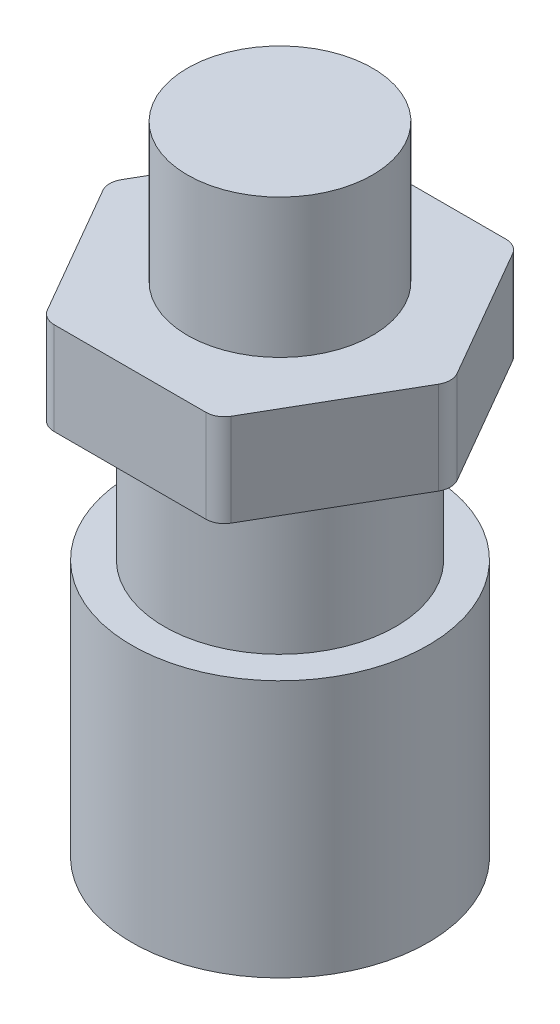
ISO-10303-21;
HEADER;
FILE_DESCRIPTION(('STEP AP214'),'2;1');
FILE_NAME('part.step','',(''),(''),'','','');
FILE_SCHEMA(('AUTOMOTIVE_DESIGN { 1 0 10303 214 1 1 1 1 }'));
ENDSEC;
DATA;
#1=APPLICATION_CONTEXT('core data for automotive mechanical design processes');
#2=APPLICATION_PROTOCOL_DEFINITION('international standard','automotive_design',2000,#1);
#3=PRODUCT_CONTEXT('',#1,'mechanical');
#4=PRODUCT('Part','Part','',(#3));
#5=PRODUCT_RELATED_PRODUCT_CATEGORY('part','',(#4));
#6=PRODUCT_DEFINITION_FORMATION('','',#4);
#7=PRODUCT_DEFINITION_CONTEXT('part definition',#1,'design');
#8=PRODUCT_DEFINITION('design','',#6,#7);
#9=PRODUCT_DEFINITION_SHAPE('','',#8);
#10=(LENGTH_UNIT() NAMED_UNIT(*) SI_UNIT(.MILLI.,.METRE.));
#11=(NAMED_UNIT(*) PLANE_ANGLE_UNIT() SI_UNIT($,.RADIAN.));
#12=(NAMED_UNIT(*) SI_UNIT($,.STERADIAN.) SOLID_ANGLE_UNIT());
#13=UNCERTAINTY_MEASURE_WITH_UNIT(LENGTH_MEASURE(1.E-05),#10,'distance_accuracy_value','');
#14=(GEOMETRIC_REPRESENTATION_CONTEXT(3) GLOBAL_UNCERTAINTY_ASSIGNED_CONTEXT((#13)) GLOBAL_UNIT_ASSIGNED_CONTEXT((#10,
#11,#12)) REPRESENTATION_CONTEXT('',''));
#15=CARTESIAN_POINT('',(0.,0.,0.));
#16=DIRECTION('',(0.,0.,1.));
#17=DIRECTION('',(1.,0.,0.));
#18=AXIS2_PLACEMENT_3D('',#15,#16,#17);
#19=CARTESIAN_POINT('',(-23.7568088766147,12.7,0.));
#20=DIRECTION('',(0.866025403784439,0.,0.5));
#21=DIRECTION('',(0.5,0.,-0.866025403784439));
#22=AXIS2_PLACEMENT_3D('',#19,#20,#21);
#23=PLANE('',#22);
#24=DIRECTION('',(-0.5,0.,0.866025403784439));
#25=VECTOR('',#24,1.);
#26=CARTESIAN_POINT('',(-23.7568088766147,0.,0.));
#27=LINE('',#26,#25);
#28=CARTESIAN_POINT('',(-12.6116392801782,0.,-19.304));
#29=VERTEX_POINT('',#28);
#30=CARTESIAN_POINT('',(-23.0235740347439,0.,-1.27));
#31=VERTEX_POINT('',#30);
#32=EDGE_CURVE('E162',#29,#31,#27,.T.);
#33=ORIENTED_EDGE('',*,*,#32,.T.);
#34=DIRECTION('',(0.,-1.,0.));
#35=VECTOR('',#34,1.);
#36=CARTESIAN_POINT('',(-23.0235740347439,12.7,-1.27));
#37=LINE('',#36,#35);
#38=CARTESIAN_POINT('',(-23.0235740347439,12.7,-1.27));
#39=VERTEX_POINT('',#38);
#40=EDGE_CURVE('E197',#31,#39,#37,.F.);
#41=ORIENTED_EDGE('',*,*,#40,.T.);
#42=DIRECTION('',(-0.5,0.,0.866025403784439));
#43=VECTOR('',#42,1.);
#44=CARTESIAN_POINT('',(-23.7568088766147,12.7,0.));
#45=LINE('',#44,#43);
#46=CARTESIAN_POINT('',(-12.6116392801782,12.7,-19.304));
#47=VERTEX_POINT('',#46);
#48=EDGE_CURVE('E170',#47,#39,#45,.T.);
#49=ORIENTED_EDGE('',*,*,#48,.F.);
#50=DIRECTION('',(0.,-1.,0.));
#51=VECTOR('',#50,1.);
#52=CARTESIAN_POINT('',(-12.6116392801782,12.7,-19.304));
#53=LINE('',#52,#51);
#54=EDGE_CURVE('E194',#47,#29,#53,.T.);
#55=ORIENTED_EDGE('',*,*,#54,.T.);
#56=EDGE_LOOP('',(#33,#41,#49,#55));
#57=FACE_BOUND('',#56,.T.);
#58=ADVANCED_FACE('F36',(#57),#23,.F.);
#59=CARTESIAN_POINT('',(-11.8784044383074,12.7,20.574));
#60=DIRECTION('',(0.866025403784439,0.,-0.5));
#61=DIRECTION('',(-0.5,0.,-0.866025403784439));
#62=AXIS2_PLACEMENT_3D('',#59,#60,#61);
#63=PLANE('',#62);
#64=DIRECTION('',(0.5,0.,0.866025403784439));
#65=VECTOR('',#64,1.);
#66=CARTESIAN_POINT('',(-11.8784044383074,0.,20.574));
#67=LINE('',#66,#65);
#68=CARTESIAN_POINT('',(-23.0235740347439,0.,1.26999999999999));
#69=VERTEX_POINT('',#68);
#70=CARTESIAN_POINT('',(-12.6116392801782,0.,19.304));
#71=VERTEX_POINT('',#70);
#72=EDGE_CURVE('E157',#69,#71,#67,.T.);
#73=ORIENTED_EDGE('',*,*,#72,.T.);
#74=DIRECTION('',(0.,-1.,0.));
#75=VECTOR('',#74,1.);
#76=CARTESIAN_POINT('',(-12.6116392801782,12.7,19.304));
#77=LINE('',#76,#75);
#78=CARTESIAN_POINT('',(-12.6116392801782,12.7,19.304));
#79=VERTEX_POINT('',#78);
#80=EDGE_CURVE('E133',#71,#79,#77,.F.);
#81=ORIENTED_EDGE('',*,*,#80,.T.);
#82=DIRECTION('',(0.5,0.,0.866025403784439));
#83=VECTOR('',#82,1.);
#84=CARTESIAN_POINT('',(-11.8784044383074,12.7,20.574));
#85=LINE('',#84,#83);
#86=CARTESIAN_POINT('',(-23.0235740347439,12.7,1.26999999999999));
#87=VERTEX_POINT('',#86);
#88=EDGE_CURVE('E249',#87,#79,#85,.T.);
#89=ORIENTED_EDGE('',*,*,#88,.F.);
#90=DIRECTION('',(0.,-1.,0.));
#91=VECTOR('',#90,1.);
#92=CARTESIAN_POINT('',(-23.0235740347439,12.7,1.27));
#93=LINE('',#92,#91);
#94=EDGE_CURVE('E138',#87,#69,#93,.T.);
#95=ORIENTED_EDGE('',*,*,#94,.T.);
#96=EDGE_LOOP('',(#73,#81,#89,#95));
#97=FACE_BOUND('',#96,.T.);
#98=ADVANCED_FACE('F264',(#97),#63,.F.);
#99=CARTESIAN_POINT('',(11.8784044383074,12.7,20.574));
#100=DIRECTION('',(0.,0.,-1.));
#101=DIRECTION('',(-1.,0.,0.));
#102=AXIS2_PLACEMENT_3D('',#99,#100,#101);
#103=PLANE('',#102);
#104=DIRECTION('',(1.,0.,0.));
#105=VECTOR('',#104,1.);
#106=CARTESIAN_POINT('',(11.8784044383074,12.7,20.574));
#107=LINE('',#106,#105);
#108=CARTESIAN_POINT('',(-10.4119347545657,12.7,20.574));
#109=VERTEX_POINT('',#108);
#110=CARTESIAN_POINT('',(10.4119347545657,12.7,20.574));
#111=VERTEX_POINT('',#110);
#112=EDGE_CURVE('E148',#109,#111,#107,.T.);
#113=ORIENTED_EDGE('',*,*,#112,.F.);
#114=DIRECTION('',(0.,-1.,0.));
#115=VECTOR('',#114,1.);
#116=CARTESIAN_POINT('',(-10.4119347545657,12.7,20.574));
#117=LINE('',#116,#115);
#118=CARTESIAN_POINT('',(-10.4119347545657,0.,20.574));
#119=VERTEX_POINT('',#118);
#120=EDGE_CURVE('E132',#109,#119,#117,.T.);
#121=ORIENTED_EDGE('',*,*,#120,.T.);
#122=DIRECTION('',(1.,0.,0.));
#123=VECTOR('',#122,1.);
#124=CARTESIAN_POINT('',(11.8784044383074,0.,20.574));
#125=LINE('',#124,#123);
#126=CARTESIAN_POINT('',(10.4119347545657,0.,20.574));
#127=VERTEX_POINT('',#126);
#128=EDGE_CURVE('E145',#119,#127,#125,.T.);
#129=ORIENTED_EDGE('',*,*,#128,.T.);
#130=DIRECTION('',(0.,-1.,0.));
#131=VECTOR('',#130,1.);
#132=CARTESIAN_POINT('',(10.4119347545657,12.7,20.574));
#133=LINE('',#132,#131);
#134=EDGE_CURVE('E150',#127,#111,#133,.F.);
#135=ORIENTED_EDGE('',*,*,#134,.T.);
#136=EDGE_LOOP('',(#113,#121,#129,#135));
#137=FACE_BOUND('',#136,.T.);
#138=ADVANCED_FACE('F144',(#137),#103,.F.);
#139=CARTESIAN_POINT('',(23.7568088766147,12.7,0.));
#140=DIRECTION('',(-0.866025403784438,0.,-0.5));
#141=DIRECTION('',(-0.5,0.,0.866025403784439));
#142=AXIS2_PLACEMENT_3D('',#139,#140,#141);
#143=PLANE('',#142);
#144=DIRECTION('',(0.5,0.,-0.866025403784439));
#145=VECTOR('',#144,1.);
#146=CARTESIAN_POINT('',(23.7568088766147,12.7,0.));
#147=LINE('',#146,#145);
#148=CARTESIAN_POINT('',(12.6116392801782,12.7,19.304));
#149=VERTEX_POINT('',#148);
#150=CARTESIAN_POINT('',(23.0235740347439,12.7,1.27));
#151=VERTEX_POINT('',#150);
#152=EDGE_CURVE('E215',#149,#151,#147,.T.);
#153=ORIENTED_EDGE('',*,*,#152,.F.);
#154=DIRECTION('',(0.,-1.,0.));
#155=VECTOR('',#154,1.);
#156=CARTESIAN_POINT('',(12.6116392801782,12.7,19.304));
#157=LINE('',#156,#155);
#158=CARTESIAN_POINT('',(12.6116392801782,0.,19.304));
#159=VERTEX_POINT('',#158);
#160=EDGE_CURVE('E40',#149,#159,#157,.T.);
#161=ORIENTED_EDGE('',*,*,#160,.T.);
#162=DIRECTION('',(0.5,0.,-0.866025403784439));
#163=VECTOR('',#162,1.);
#164=CARTESIAN_POINT('',(23.7568088766147,0.,0.));
#165=LINE('',#164,#163);
#166=CARTESIAN_POINT('',(23.0235740347439,0.,1.27));
#167=VERTEX_POINT('',#166);
#168=EDGE_CURVE('E156',#159,#167,#165,.T.);
#169=ORIENTED_EDGE('',*,*,#168,.T.);
#170=DIRECTION('',(0.,-1.,0.));
#171=VECTOR('',#170,1.);
#172=CARTESIAN_POINT('',(23.0235740347439,12.7,1.27));
#173=LINE('',#172,#171);
#174=EDGE_CURVE('E207',#167,#151,#173,.F.);
#175=ORIENTED_EDGE('',*,*,#174,.T.);
#176=EDGE_LOOP('',(#153,#161,#169,#175));
#177=FACE_BOUND('',#176,.T.);
#178=ADVANCED_FACE('F214',(#177),#143,.F.);
#179=CARTESIAN_POINT('',(11.8784044383074,12.7,-20.574));
#180=DIRECTION('',(-0.866025403784439,0.,0.5));
#181=DIRECTION('',(0.5,0.,0.866025403784439));
#182=AXIS2_PLACEMENT_3D('',#179,#180,#181);
#183=PLANE('',#182);
#184=DIRECTION('',(-0.5,0.,-0.866025403784439));
#185=VECTOR('',#184,1.);
#186=CARTESIAN_POINT('',(11.8784044383074,0.,-20.574));
#187=LINE('',#186,#185);
#188=CARTESIAN_POINT('',(23.0235740347439,0.,-1.27));
#189=VERTEX_POINT('',#188);
#190=CARTESIAN_POINT('',(12.6116392801782,0.,-19.304));
#191=VERTEX_POINT('',#190);
#192=EDGE_CURVE('E160',#189,#191,#187,.T.);
#193=ORIENTED_EDGE('',*,*,#192,.T.);
#194=DIRECTION('',(0.,-1.,0.));
#195=VECTOR('',#194,1.);
#196=CARTESIAN_POINT('',(12.6116392801782,12.7,-19.304));
#197=LINE('',#196,#195);
#198=CARTESIAN_POINT('',(12.6116392801782,12.7,-19.304));
#199=VERTEX_POINT('',#198);
#200=EDGE_CURVE('E206',#191,#199,#197,.F.);
#201=ORIENTED_EDGE('',*,*,#200,.T.);
#202=DIRECTION('',(-0.5,0.,-0.866025403784439));
#203=VECTOR('',#202,1.);
#204=CARTESIAN_POINT('',(11.8784044383074,12.7,-20.574));
#205=LINE('',#204,#203);
#206=CARTESIAN_POINT('',(23.0235740347439,12.7,-1.27));
#207=VERTEX_POINT('',#206);
#208=EDGE_CURVE('E226',#207,#199,#205,.T.);
#209=ORIENTED_EDGE('',*,*,#208,.F.);
#210=DIRECTION('',(0.,-1.,0.));
#211=VECTOR('',#210,1.);
#212=CARTESIAN_POINT('',(23.0235740347439,12.7,-1.27));
#213=LINE('',#212,#211);
#214=EDGE_CURVE('E203',#207,#189,#213,.T.);
#215=ORIENTED_EDGE('',*,*,#214,.T.);
#216=EDGE_LOOP('',(#193,#201,#209,#215));
#217=FACE_BOUND('',#216,.T.);
#218=ADVANCED_FACE('F224',(#217),#183,.F.);
#219=CARTESIAN_POINT('',(-11.8784044383074,12.7,-20.574));
#220=DIRECTION('',(0.,0.,1.));
#221=DIRECTION('',(1.,0.,0.));
#222=AXIS2_PLACEMENT_3D('',#219,#220,#221);
#223=PLANE('',#222);
#224=DIRECTION('',(-1.,0.,0.));
#225=VECTOR('',#224,1.);
#226=CARTESIAN_POINT('',(-11.8784044383074,0.,-20.574));
#227=LINE('',#226,#225);
#228=CARTESIAN_POINT('',(10.4119347545657,0.,-20.574));
#229=VERTEX_POINT('',#228);
#230=CARTESIAN_POINT('',(-10.4119347545657,0.,-20.574));
#231=VERTEX_POINT('',#230);
#232=EDGE_CURVE('E168',#229,#231,#227,.T.);
#233=ORIENTED_EDGE('',*,*,#232,.T.);
#234=DIRECTION('',(0.,-1.,0.));
#235=VECTOR('',#234,1.);
#236=CARTESIAN_POINT('',(-10.4119347545657,12.7,-20.574));
#237=LINE('',#236,#235);
#238=CARTESIAN_POINT('',(-10.4119347545657,12.7,-20.574));
#239=VERTEX_POINT('',#238);
#240=EDGE_CURVE('E52',#231,#239,#237,.F.);
#241=ORIENTED_EDGE('',*,*,#240,.T.);
#242=DIRECTION('',(-1.,0.,0.));
#243=VECTOR('',#242,1.);
#244=CARTESIAN_POINT('',(-11.8784044383074,12.7,-20.574));
#245=LINE('',#244,#243);
#246=CARTESIAN_POINT('',(10.4119347545657,12.7,-20.574));
#247=VERTEX_POINT('',#246);
#248=EDGE_CURVE('E171',#247,#239,#245,.T.);
#249=ORIENTED_EDGE('',*,*,#248,.F.);
#250=DIRECTION('',(0.,-1.,0.));
#251=VECTOR('',#250,1.);
#252=CARTESIAN_POINT('',(10.4119347545657,12.7,-20.574));
#253=LINE('',#252,#251);
#254=EDGE_CURVE('E199',#247,#229,#253,.T.);
#255=ORIENTED_EDGE('',*,*,#254,.T.);
#256=EDGE_LOOP('',(#233,#241,#249,#255));
#257=FACE_BOUND('',#256,.T.);
#258=ADVANCED_FACE('F290',(#257),#223,.F.);
#259=CARTESIAN_POINT('',(0.,12.7,0.));
#260=DIRECTION('',(0.,-1.,0.));
#261=DIRECTION('',(0.,0.,-1.));
#262=AXIS2_PLACEMENT_3D('',#259,#260,#261);
#263=PLANE('',#262);
#264=CARTESIAN_POINT('',(0.,12.7,0.));
#265=DIRECTION('',(0.,1.,0.));
#266=DIRECTION('',(0.,0.,1.));
#267=AXIS2_PLACEMENT_3D('',#264,#265,#266);
#268=CIRCLE('',#267,12.7);
#269=CARTESIAN_POINT('',(0.,12.7,12.7));
#270=VERTEX_POINT('',#269);
#271=EDGE_CURVE('E11',#270,#270,#268,.T.);
#272=ORIENTED_EDGE('',*,*,#271,.F.);
#273=EDGE_LOOP('',(#272));
#274=FACE_BOUND('',#273,.T.);
#275=ORIENTED_EDGE('',*,*,#88,.T.);
#276=CARTESIAN_POINT('',(-10.4119347545657,12.7,18.034));
#277=DIRECTION('',(0.,-1.,0.));
#278=DIRECTION('',(0.,0.,-1.));
#279=AXIS2_PLACEMENT_3D('',#276,#277,#278);
#280=CIRCLE('',#279,2.54);
#281=EDGE_CURVE('E192',#79,#109,#280,.F.);
#282=ORIENTED_EDGE('',*,*,#281,.T.);
#283=ORIENTED_EDGE('',*,*,#112,.T.);
#284=CARTESIAN_POINT('',(10.4119347545657,12.7,18.034));
#285=DIRECTION('',(0.,-1.,0.));
#286=DIRECTION('',(0.,0.,-1.));
#287=AXIS2_PLACEMENT_3D('',#284,#285,#286);
#288=CIRCLE('',#287,2.54);
#289=EDGE_CURVE('E185',#111,#149,#288,.F.);
#290=ORIENTED_EDGE('',*,*,#289,.T.);
#291=ORIENTED_EDGE('',*,*,#152,.T.);
#292=CARTESIAN_POINT('',(20.8238695091314,12.7,0.));
#293=DIRECTION('',(0.,-1.,0.));
#294=DIRECTION('',(0.,0.,-1.));
#295=AXIS2_PLACEMENT_3D('',#292,#293,#294);
#296=CIRCLE('',#295,2.54);
#297=EDGE_CURVE('E183',#151,#207,#296,.F.);
#298=ORIENTED_EDGE('',*,*,#297,.T.);
#299=ORIENTED_EDGE('',*,*,#208,.T.);
#300=CARTESIAN_POINT('',(10.4119347545657,12.7,-18.034));
#301=DIRECTION('',(0.,-1.,0.));
#302=DIRECTION('',(0.,0.,-1.));
#303=AXIS2_PLACEMENT_3D('',#300,#301,#302);
#304=CIRCLE('',#303,2.54);
#305=EDGE_CURVE('E59',#199,#247,#304,.F.);
#306=ORIENTED_EDGE('',*,*,#305,.T.);
#307=ORIENTED_EDGE('',*,*,#248,.T.);
#308=CARTESIAN_POINT('',(-10.4119347545657,12.7,-18.034));
#309=DIRECTION('',(0.,-1.,0.));
#310=DIRECTION('',(0.,0.,-1.));
#311=AXIS2_PLACEMENT_3D('',#308,#309,#310);
#312=CIRCLE('',#311,2.54);
#313=EDGE_CURVE('E188',#239,#47,#312,.F.);
#314=ORIENTED_EDGE('',*,*,#313,.T.);
#315=ORIENTED_EDGE('',*,*,#48,.T.);
#316=CARTESIAN_POINT('',(-20.8238695091314,12.7,0.));
#317=DIRECTION('',(0.,-1.,0.));
#318=DIRECTION('',(0.,0.,-1.));
#319=AXIS2_PLACEMENT_3D('',#316,#317,#318);
#320=CIRCLE('',#319,2.54);
#321=EDGE_CURVE('E190',#39,#87,#320,.F.);
#322=ORIENTED_EDGE('',*,*,#321,.T.);
#323=EDGE_LOOP('',(#275,#282,#283,#290,#291,#298,#299,#306,#307,#314,#315,#322));
#324=FACE_BOUND('',#323,.T.);
#325=ADVANCED_FACE('F251',(#274,#324),#263,.F.);
#326=CARTESIAN_POINT('',(0.,0.,0.));
#327=DIRECTION('',(0.,-1.,0.));
#328=DIRECTION('',(0.,0.,-1.));
#329=AXIS2_PLACEMENT_3D('',#326,#327,#328);
#330=PLANE('',#329);
#331=ORIENTED_EDGE('',*,*,#128,.F.);
#332=CARTESIAN_POINT('',(-10.4119347545657,0.,18.034));
#333=DIRECTION('',(0.,-1.,0.));
#334=DIRECTION('',(0.,0.,-1.));
#335=AXIS2_PLACEMENT_3D('',#332,#333,#334);
#336=CIRCLE('',#335,2.54);
#337=EDGE_CURVE('E128',#119,#71,#336,.T.);
#338=ORIENTED_EDGE('',*,*,#337,.T.);
#339=ORIENTED_EDGE('',*,*,#72,.F.);
#340=CARTESIAN_POINT('',(-20.8238695091314,0.,0.));
#341=DIRECTION('',(0.,-1.,0.));
#342=DIRECTION('',(0.,0.,-1.));
#343=AXIS2_PLACEMENT_3D('',#340,#341,#342);
#344=CIRCLE('',#343,2.54);
#345=EDGE_CURVE('E139',#69,#31,#344,.T.);
#346=ORIENTED_EDGE('',*,*,#345,.T.);
#347=ORIENTED_EDGE('',*,*,#32,.F.);
#348=CARTESIAN_POINT('',(-10.4119347545657,0.,-18.034));
#349=DIRECTION('',(0.,-1.,0.));
#350=DIRECTION('',(0.,0.,-1.));
#351=AXIS2_PLACEMENT_3D('',#348,#349,#350);
#352=CIRCLE('',#351,2.54);
#353=EDGE_CURVE('E177',#29,#231,#352,.T.);
#354=ORIENTED_EDGE('',*,*,#353,.T.);
#355=ORIENTED_EDGE('',*,*,#232,.F.);
#356=CARTESIAN_POINT('',(10.4119347545657,0.,-18.034));
#357=DIRECTION('',(0.,-1.,0.));
#358=DIRECTION('',(0.,0.,-1.));
#359=AXIS2_PLACEMENT_3D('',#356,#357,#358);
#360=CIRCLE('',#359,2.54);
#361=EDGE_CURVE('E175',#229,#191,#360,.T.);
#362=ORIENTED_EDGE('',*,*,#361,.T.);
#363=ORIENTED_EDGE('',*,*,#192,.F.);
#364=CARTESIAN_POINT('',(20.8238695091314,0.,0.));
#365=DIRECTION('',(0.,-1.,0.));
#366=DIRECTION('',(0.,0.,-1.));
#367=AXIS2_PLACEMENT_3D('',#364,#365,#366);
#368=CIRCLE('',#367,2.54);
#369=EDGE_CURVE('E149',#189,#167,#368,.T.);
#370=ORIENTED_EDGE('',*,*,#369,.T.);
#371=ORIENTED_EDGE('',*,*,#168,.F.);
#372=CARTESIAN_POINT('',(10.4119347545657,0.,18.034));
#373=DIRECTION('',(0.,-1.,0.));
#374=DIRECTION('',(0.,0.,-1.));
#375=AXIS2_PLACEMENT_3D('',#372,#373,#374);
#376=CIRCLE('',#375,2.54);
#377=EDGE_CURVE('E155',#159,#127,#376,.T.);
#378=ORIENTED_EDGE('',*,*,#377,.T.);
#379=EDGE_LOOP('',(#331,#338,#339,#346,#347,#354,#355,#362,#363,#370,#371,#378));
#380=FACE_BOUND('',#379,.T.);
#381=CARTESIAN_POINT('',(0.,0.,0.));
#382=DIRECTION('',(0.,-1.,0.));
#383=DIRECTION('',(0.,0.,-1.));
#384=AXIS2_PLACEMENT_3D('',#381,#382,#383);
#385=CIRCLE('',#384,15.875);
#386=CARTESIAN_POINT('',(0.,0.,-15.875));
#387=VERTEX_POINT('',#386);
#388=EDGE_CURVE('E246',#387,#387,#385,.T.);
#389=ORIENTED_EDGE('',*,*,#388,.F.);
#390=EDGE_LOOP('',(#389));
#391=FACE_BOUND('',#390,.T.);
#392=ADVANCED_FACE('F152',(#380,#391),#330,.T.);
#393=CARTESIAN_POINT('',(-10.4119347545657,12.7,18.034));
#394=DIRECTION('',(0.,-1.,0.));
#395=DIRECTION('',(0.,0.,-1.));
#396=AXIS2_PLACEMENT_3D('',#393,#394,#395);
#397=CYLINDRICAL_SURFACE('',#396,2.54);
#398=ORIENTED_EDGE('',*,*,#281,.F.);
#399=ORIENTED_EDGE('',*,*,#80,.F.);
#400=ORIENTED_EDGE('',*,*,#337,.F.);
#401=ORIENTED_EDGE('',*,*,#120,.F.);
#402=EDGE_LOOP('',(#398,#399,#400,#401));
#403=FACE_BOUND('',#402,.T.);
#404=ADVANCED_FACE('F131',(#403),#397,.T.);
#405=CARTESIAN_POINT('',(-20.8238695091314,12.7,0.));
#406=DIRECTION('',(0.,-1.,0.));
#407=DIRECTION('',(0.,0.,-1.));
#408=AXIS2_PLACEMENT_3D('',#405,#406,#407);
#409=CYLINDRICAL_SURFACE('',#408,2.54);
#410=ORIENTED_EDGE('',*,*,#321,.F.);
#411=ORIENTED_EDGE('',*,*,#40,.F.);
#412=ORIENTED_EDGE('',*,*,#345,.F.);
#413=ORIENTED_EDGE('',*,*,#94,.F.);
#414=EDGE_LOOP('',(#410,#411,#412,#413));
#415=FACE_BOUND('',#414,.T.);
#416=ADVANCED_FACE('F275',(#415),#409,.T.);
#417=CARTESIAN_POINT('',(-10.4119347545657,12.7,-18.034));
#418=DIRECTION('',(0.,-1.,0.));
#419=DIRECTION('',(0.,0.,-1.));
#420=AXIS2_PLACEMENT_3D('',#417,#418,#419);
#421=CYLINDRICAL_SURFACE('',#420,2.54);
#422=ORIENTED_EDGE('',*,*,#313,.F.);
#423=ORIENTED_EDGE('',*,*,#240,.F.);
#424=ORIENTED_EDGE('',*,*,#353,.F.);
#425=ORIENTED_EDGE('',*,*,#54,.F.);
#426=EDGE_LOOP('',(#422,#423,#424,#425));
#427=FACE_BOUND('',#426,.T.);
#428=ADVANCED_FACE('F260',(#427),#421,.T.);
#429=CARTESIAN_POINT('',(10.4119347545657,12.7,-18.034));
#430=DIRECTION('',(0.,-1.,0.));
#431=DIRECTION('',(0.,0.,-1.));
#432=AXIS2_PLACEMENT_3D('',#429,#430,#431);
#433=CYLINDRICAL_SURFACE('',#432,2.54);
#434=ORIENTED_EDGE('',*,*,#305,.F.);
#435=ORIENTED_EDGE('',*,*,#200,.F.);
#436=ORIENTED_EDGE('',*,*,#361,.F.);
#437=ORIENTED_EDGE('',*,*,#254,.F.);
#438=EDGE_LOOP('',(#434,#435,#436,#437));
#439=FACE_BOUND('',#438,.T.);
#440=ADVANCED_FACE('F254',(#439),#433,.T.);
#441=CARTESIAN_POINT('',(10.4119347545657,12.7,18.034));
#442=DIRECTION('',(0.,-1.,0.));
#443=DIRECTION('',(0.,0.,-1.));
#444=AXIS2_PLACEMENT_3D('',#441,#442,#443);
#445=CYLINDRICAL_SURFACE('',#444,2.54);
#446=ORIENTED_EDGE('',*,*,#289,.F.);
#447=ORIENTED_EDGE('',*,*,#134,.F.);
#448=ORIENTED_EDGE('',*,*,#377,.F.);
#449=ORIENTED_EDGE('',*,*,#160,.F.);
#450=EDGE_LOOP('',(#446,#447,#448,#449));
#451=FACE_BOUND('',#450,.T.);
#452=ADVANCED_FACE('F252',(#451),#445,.T.);
#453=CARTESIAN_POINT('',(20.8238695091314,12.7,0.));
#454=DIRECTION('',(0.,-1.,0.));
#455=DIRECTION('',(0.,0.,-1.));
#456=AXIS2_PLACEMENT_3D('',#453,#454,#455);
#457=CYLINDRICAL_SURFACE('',#456,2.54);
#458=ORIENTED_EDGE('',*,*,#297,.F.);
#459=ORIENTED_EDGE('',*,*,#174,.F.);
#460=ORIENTED_EDGE('',*,*,#369,.F.);
#461=ORIENTED_EDGE('',*,*,#214,.F.);
#462=EDGE_LOOP('',(#458,#459,#460,#461));
#463=FACE_BOUND('',#462,.T.);
#464=ADVANCED_FACE('F38',(#463),#457,.T.);
#465=CARTESIAN_POINT('',(0.,-20.32,0.));
#466=DIRECTION('',(0.,1.,0.));
#467=DIRECTION('',(0.,0.,1.));
#468=AXIS2_PLACEMENT_3D('',#465,#466,#467);
#469=CYLINDRICAL_SURFACE('',#468,15.875);
#470=CARTESIAN_POINT('',(0.,-20.32,0.));
#471=DIRECTION('',(0.,-1.,0.));
#472=DIRECTION('',(0.,0.,-1.));
#473=AXIS2_PLACEMENT_3D('',#470,#471,#472);
#474=CIRCLE('',#473,15.875);
#475=CARTESIAN_POINT('',(0.,-20.32,-15.875));
#476=VERTEX_POINT('',#475);
#477=EDGE_CURVE('E242',#476,#476,#474,.T.);
#478=ORIENTED_EDGE('',*,*,#477,.F.);
#479=EDGE_LOOP('',(#478));
#480=FACE_BOUND('',#479,.T.);
#481=ORIENTED_EDGE('',*,*,#388,.T.);
#482=EDGE_LOOP('',(#481));
#483=FACE_BOUND('',#482,.T.);
#484=ADVANCED_FACE('F259',(#480,#483),#469,.T.);
#485=CARTESIAN_POINT('',(0.,-20.32,0.));
#486=DIRECTION('',(0.,-1.,0.));
#487=DIRECTION('',(0.,0.,-1.));
#488=AXIS2_PLACEMENT_3D('',#485,#486,#487);
#489=PLANE('',#488);
#490=ORIENTED_EDGE('',*,*,#477,.T.);
#491=EDGE_LOOP('',(#490));
#492=FACE_BOUND('',#491,.T.);
#493=CARTESIAN_POINT('',(0.,-20.32,0.));
#494=DIRECTION('',(0.,-1.,0.));
#495=DIRECTION('',(0.,0.,-1.));
#496=AXIS2_PLACEMENT_3D('',#493,#494,#495);
#497=CIRCLE('',#496,20.32);
#498=CARTESIAN_POINT('',(0.,-20.32,-20.32));
#499=VERTEX_POINT('',#498);
#500=EDGE_CURVE('E237',#499,#499,#497,.F.);
#501=ORIENTED_EDGE('',*,*,#500,.T.);
#502=EDGE_LOOP('',(#501));
#503=FACE_BOUND('',#502,.T.);
#504=ADVANCED_FACE('F369',(#492,#503),#489,.F.);
#505=CARTESIAN_POINT('',(0.,-55.626,0.));
#506=DIRECTION('',(0.,-1.,0.));
#507=DIRECTION('',(0.,0.,-1.));
#508=AXIS2_PLACEMENT_3D('',#505,#506,#507);
#509=PLANE('',#508);
#510=CARTESIAN_POINT('',(0.,-55.626,0.));
#511=DIRECTION('',(0.,-1.,0.));
#512=DIRECTION('',(0.,0.,-1.));
#513=AXIS2_PLACEMENT_3D('',#510,#511,#512);
#514=CIRCLE('',#513,20.32);
#515=CARTESIAN_POINT('',(0.,-55.626,-20.32));
#516=VERTEX_POINT('',#515);
#517=EDGE_CURVE('E232',#516,#516,#514,.T.);
#518=ORIENTED_EDGE('',*,*,#517,.T.);
#519=EDGE_LOOP('',(#518));
#520=FACE_BOUND('',#519,.T.);
#521=ADVANCED_FACE('F363',(#520),#509,.T.);
#522=CARTESIAN_POINT('',(0.,-55.626,0.));
#523=DIRECTION('',(0.,1.,0.));
#524=DIRECTION('',(0.,0.,1.));
#525=AXIS2_PLACEMENT_3D('',#522,#523,#524);
#526=CYLINDRICAL_SURFACE('',#525,20.32);
#527=ORIENTED_EDGE('',*,*,#500,.F.);
#528=EDGE_LOOP('',(#527));
#529=FACE_BOUND('',#528,.T.);
#530=ORIENTED_EDGE('',*,*,#517,.F.);
#531=EDGE_LOOP('',(#530));
#532=FACE_BOUND('',#531,.T.);
#533=ADVANCED_FACE('F368',(#529,#532),#526,.T.);
#534=CARTESIAN_POINT('',(0.,31.75,0.));
#535=DIRECTION('',(0.,-1.,0.));
#536=DIRECTION('',(0.,0.,-1.));
#537=AXIS2_PLACEMENT_3D('',#534,#535,#536);
#538=CYLINDRICAL_SURFACE('',#537,12.7);
#539=CARTESIAN_POINT('',(0.,31.75,0.));
#540=DIRECTION('',(0.,1.,0.));
#541=DIRECTION('',(0.,0.,1.));
#542=AXIS2_PLACEMENT_3D('',#539,#540,#541);
#543=CIRCLE('',#542,12.7);
#544=CARTESIAN_POINT('',(0.,31.75,12.7));
#545=VERTEX_POINT('',#544);
#546=EDGE_CURVE('E433',#545,#545,#543,.T.);
#547=ORIENTED_EDGE('',*,*,#546,.F.);
#548=EDGE_LOOP('',(#547));
#549=FACE_BOUND('',#548,.T.);
#550=ORIENTED_EDGE('',*,*,#271,.T.);
#551=EDGE_LOOP('',(#550));
#552=FACE_BOUND('',#551,.T.);
#553=ADVANCED_FACE('F403',(#549,#552),#538,.T.);
#554=CARTESIAN_POINT('',(0.,31.75,0.));
#555=DIRECTION('',(0.,1.,0.));
#556=DIRECTION('',(0.,0.,1.));
#557=AXIS2_PLACEMENT_3D('',#554,#555,#556);
#558=PLANE('',#557);
#559=ORIENTED_EDGE('',*,*,#546,.T.);
#560=EDGE_LOOP('',(#559));
#561=FACE_BOUND('',#560,.T.);
#562=ADVANCED_FACE('F417',(#561),#558,.T.);
#563=CLOSED_SHELL('',(#58,#98,#138,#178,#218,#258,#325,#392,#404,#416,#428,#440,#452,#464,#484,
#504,#521,#533,#553,#562));
#564=MANIFOLD_SOLID_BREP('B2',#563);
#565=ADVANCED_BREP_SHAPE_REPRESENTATION('',(#18,#564),#14);
#566=SHAPE_DEFINITION_REPRESENTATION(#9,#565);
ENDSEC;
END-ISO-10303-21;
